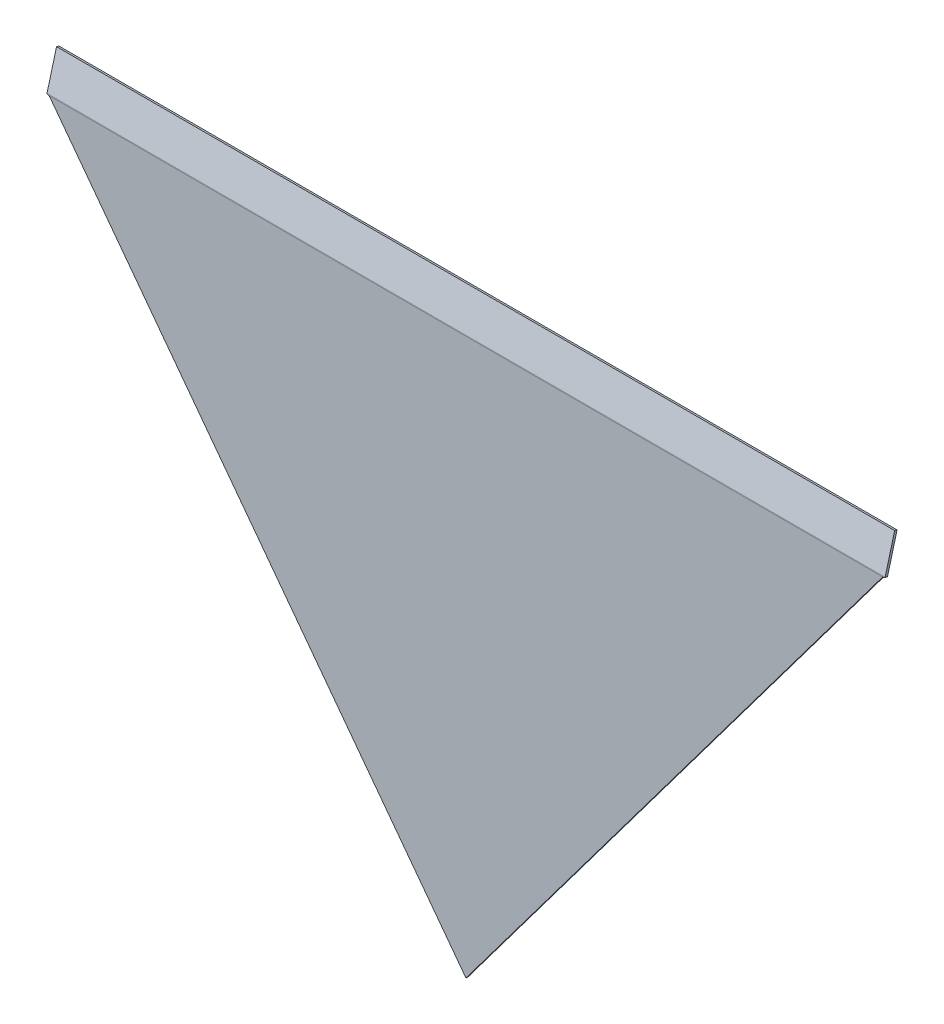
ISO-10303-21;
HEADER;
FILE_DESCRIPTION(('STEP AP214'),'2;1');
FILE_NAME('part.step','',(''),(''),'','','');
FILE_SCHEMA(('AUTOMOTIVE_DESIGN { 1 0 10303 214 1 1 1 1 }'));
ENDSEC;
DATA;
#1=APPLICATION_CONTEXT('core data for automotive mechanical design processes');
#2=APPLICATION_PROTOCOL_DEFINITION('international standard','automotive_design',2000,#1);
#3=PRODUCT_CONTEXT('',#1,'mechanical');
#4=PRODUCT('Part','Part','',(#3));
#5=PRODUCT_RELATED_PRODUCT_CATEGORY('part','',(#4));
#6=PRODUCT_DEFINITION_FORMATION('','',#4);
#7=PRODUCT_DEFINITION_CONTEXT('part definition',#1,'design');
#8=PRODUCT_DEFINITION('design','',#6,#7);
#9=PRODUCT_DEFINITION_SHAPE('','',#8);
#10=(LENGTH_UNIT() NAMED_UNIT(*) SI_UNIT(.MILLI.,.METRE.));
#11=(NAMED_UNIT(*) PLANE_ANGLE_UNIT() SI_UNIT($,.RADIAN.));
#12=(NAMED_UNIT(*) SI_UNIT($,.STERADIAN.) SOLID_ANGLE_UNIT());
#13=UNCERTAINTY_MEASURE_WITH_UNIT(LENGTH_MEASURE(1.E-05),#10,'distance_accuracy_value','');
#14=(GEOMETRIC_REPRESENTATION_CONTEXT(3) GLOBAL_UNCERTAINTY_ASSIGNED_CONTEXT((#13)) GLOBAL_UNIT_ASSIGNED_CONTEXT((#10,
#11,#12)) REPRESENTATION_CONTEXT('',''));
#15=CARTESIAN_POINT('',(0.,0.,0.));
#16=DIRECTION('',(0.,0.,1.));
#17=DIRECTION('',(1.,0.,0.));
#18=AXIS2_PLACEMENT_3D('',#15,#16,#17);
#19=CARTESIAN_POINT('',(0.,-8.20217484210808,-10.7085569512675));
#20=DIRECTION('',(0.,0.258819045102521,0.965925826289068));
#21=DIRECTION('',(1.,0.,0.));
#22=AXIS2_PLACEMENT_3D('',#19,#20,#21);
#23=PLANE('',#22);
#24=DIRECTION('',(0.,-0.965925826289068,0.258819045102521));
#25=VECTOR('',#24,1.);
#26=CARTESIAN_POINT('',(-533.4,-8.20217484210808,-10.7085569512675));
#27=LINE('',#26,#25);
#28=CARTESIAN_POINT('',(-533.4,-8.20217484210808,-10.7085569512675));
#29=VERTEX_POINT('',#28);
#30=CARTESIAN_POINT('',(-533.4,-53.5910294194315,1.45334997810006));
#31=VERTEX_POINT('',#30);
#32=EDGE_CURVE('E82',#29,#31,#27,.T.);
#33=ORIENTED_EDGE('',*,*,#32,.T.);
#34=DIRECTION('',(1.,0.,0.));
#35=VECTOR('',#34,1.);
#36=CARTESIAN_POINT('',(0.,-53.5910294194315,1.45334997810006));
#37=LINE('',#36,#35);
#38=CARTESIAN_POINT('',(533.4,-53.5910294194315,1.45334997810006));
#39=VERTEX_POINT('',#38);
#40=EDGE_CURVE('E43',#31,#39,#37,.T.);
#41=ORIENTED_EDGE('',*,*,#40,.T.);
#42=DIRECTION('',(0.,0.965925826289068,-0.258819045102521));
#43=VECTOR('',#42,1.);
#44=CARTESIAN_POINT('',(533.4,-8.20217484210808,-10.7085569512675));
#45=LINE('',#44,#43);
#46=CARTESIAN_POINT('',(533.4,-8.20217484210808,-10.7085569512675));
#47=VERTEX_POINT('',#46);
#48=EDGE_CURVE('E109',#39,#47,#45,.T.);
#49=ORIENTED_EDGE('',*,*,#48,.T.);
#50=DIRECTION('',(-1.,0.,0.));
#51=VECTOR('',#50,1.);
#52=CARTESIAN_POINT('',(-533.4,-8.20217484210808,-10.7085569512675));
#53=LINE('',#52,#51);
#54=EDGE_CURVE('E59',#47,#29,#53,.T.);
#55=ORIENTED_EDGE('',*,*,#54,.T.);
#56=EDGE_LOOP('',(#33,#41,#49,#55));
#57=FACE_BOUND('',#56,.T.);
#58=ADVANCED_FACE('F35',(#57),#23,.T.);
#59=CARTESIAN_POINT('',(-533.4,-8.20217484210808,-10.7085569512675));
#60=DIRECTION('',(1.,0.,0.));
#61=DIRECTION('',(0.,-0.258819045102521,-0.965925826289068));
#62=AXIS2_PLACEMENT_3D('',#59,#60,#61);
#63=PLANE('',#62);
#64=DIRECTION('',(0.,-0.258819045102521,-0.965925826289068));
#65=VECTOR('',#64,1.);
#66=CARTESIAN_POINT('',(-533.4,-53.5910294194315,1.45334997810006));
#67=LINE('',#66,#65);
#68=CARTESIAN_POINT('',(-533.4,-54.412779887632,-1.61346452036773));
#69=VERTEX_POINT('',#68);
#70=EDGE_CURVE('E103',#31,#69,#67,.T.);
#71=ORIENTED_EDGE('',*,*,#70,.F.);
#72=ORIENTED_EDGE('',*,*,#32,.F.);
#73=DIRECTION('',(0.,-0.258819045102521,-0.965925826289068));
#74=VECTOR('',#73,1.);
#75=CARTESIAN_POINT('',(-533.4,-8.20217484210808,-10.7085569512675));
#76=LINE('',#75,#74);
#77=CARTESIAN_POINT('',(-533.4,-9.02392531030858,-13.7753714497352));
#78=VERTEX_POINT('',#77);
#79=EDGE_CURVE('E75',#29,#78,#76,.T.);
#80=ORIENTED_EDGE('',*,*,#79,.T.);
#81=DIRECTION('',(0.,-0.965925826289068,0.258819045102521));
#82=VECTOR('',#81,1.);
#83=CARTESIAN_POINT('',(-533.4,-9.02392531030858,-13.7753714497352));
#84=LINE('',#83,#82);
#85=EDGE_CURVE('E90',#78,#69,#84,.T.);
#86=ORIENTED_EDGE('',*,*,#85,.T.);
#87=EDGE_LOOP('',(#71,#72,#80,#86));
#88=FACE_BOUND('',#87,.T.);
#89=ADVANCED_FACE('F88',(#88),#63,.F.);
#90=CARTESIAN_POINT('',(533.4,-8.20217484210808,-10.7085569512675));
#91=DIRECTION('',(-1.,0.,0.));
#92=DIRECTION('',(0.,0.258819045102521,0.965925826289068));
#93=AXIS2_PLACEMENT_3D('',#90,#91,#92);
#94=PLANE('',#93);
#95=DIRECTION('',(0.,0.258819045102521,0.965925826289068));
#96=VECTOR('',#95,1.);
#97=CARTESIAN_POINT('',(533.4,-53.5910294194315,1.45334997810006));
#98=LINE('',#97,#96);
#99=CARTESIAN_POINT('',(533.399999999999,-54.412779887632,-1.61346452036773));
#100=VERTEX_POINT('',#99);
#101=EDGE_CURVE('E106',#100,#39,#98,.T.);
#102=ORIENTED_EDGE('',*,*,#101,.F.);
#103=DIRECTION('',(0.,0.965925826289068,-0.258819045102521));
#104=VECTOR('',#103,1.);
#105=CARTESIAN_POINT('',(533.4,-9.02392531030858,-13.7753714497352));
#106=LINE('',#105,#104);
#107=CARTESIAN_POINT('',(533.4,-9.02392531030858,-13.7753714497352));
#108=VERTEX_POINT('',#107);
#109=EDGE_CURVE('E83',#100,#108,#106,.T.);
#110=ORIENTED_EDGE('',*,*,#109,.T.);
#111=DIRECTION('',(0.,-0.258819045102521,-0.965925826289068));
#112=VECTOR('',#111,1.);
#113=CARTESIAN_POINT('',(533.4,-8.20217484210808,-10.7085569512675));
#114=LINE('',#113,#112);
#115=EDGE_CURVE('E78',#47,#108,#114,.T.);
#116=ORIENTED_EDGE('',*,*,#115,.F.);
#117=ORIENTED_EDGE('',*,*,#48,.F.);
#118=EDGE_LOOP('',(#102,#110,#116,#117));
#119=FACE_BOUND('',#118,.T.);
#120=ADVANCED_FACE('F115',(#119),#94,.F.);
#121=CARTESIAN_POINT('',(-533.4,-8.20217484210808,-10.7085569512675));
#122=DIRECTION('',(0.,-0.965925826289068,0.258819045102521));
#123=DIRECTION('',(0.,-0.258819045102521,-0.965925826289068));
#124=AXIS2_PLACEMENT_3D('',#121,#122,#123);
#125=PLANE('',#124);
#126=DIRECTION('',(-1.,0.,0.));
#127=VECTOR('',#126,1.);
#128=CARTESIAN_POINT('',(-533.4,-9.02392531030858,-13.7753714497352));
#129=LINE('',#128,#127);
#130=EDGE_CURVE('E72',#108,#78,#129,.T.);
#131=ORIENTED_EDGE('',*,*,#130,.T.);
#132=ORIENTED_EDGE('',*,*,#79,.F.);
#133=ORIENTED_EDGE('',*,*,#54,.F.);
#134=ORIENTED_EDGE('',*,*,#115,.T.);
#135=EDGE_LOOP('',(#131,#132,#133,#134));
#136=FACE_BOUND('',#135,.T.);
#137=ADVANCED_FACE('F74',(#136),#125,.F.);
#138=CARTESIAN_POINT('',(0.,-9.02392531030858,-13.7753714497352));
#139=DIRECTION('',(0.,0.258819045102521,0.965925826289068));
#140=DIRECTION('',(1.,0.,0.));
#141=AXIS2_PLACEMENT_3D('',#138,#139,#140);
#142=PLANE('',#141);
#143=DIRECTION('',(1.,0.,0.));
#144=VECTOR('',#143,1.);
#145=CARTESIAN_POINT('',(0.,-54.412779887632,-1.61346452036773));
#146=LINE('',#145,#144);
#147=EDGE_CURVE('E11',#69,#100,#146,.T.);
#148=ORIENTED_EDGE('',*,*,#147,.F.);
#149=ORIENTED_EDGE('',*,*,#85,.F.);
#150=ORIENTED_EDGE('',*,*,#130,.F.);
#151=ORIENTED_EDGE('',*,*,#109,.F.);
#152=EDGE_LOOP('',(#148,#149,#150,#151));
#153=FACE_BOUND('',#152,.T.);
#154=ADVANCED_FACE('F37',(#153),#142,.F.);
#155=CARTESIAN_POINT('',(533.4,-50.8000000000001,1.5875));
#156=DIRECTION('',(-0.8,0.6,0.));
#157=DIRECTION('',(-0.6,-0.8,0.));
#158=AXIS2_PLACEMENT_3D('',#155,#156,#157);
#159=PLANE('',#158);
#160=DIRECTION('',(0.6,0.8,0.));
#161=VECTOR('',#160,1.);
#162=CARTESIAN_POINT('',(533.4,-50.8000000000001,-1.5875));
#163=LINE('',#162,#161);
#164=CARTESIAN_POINT('',(0.,-762.,-1.5875));
#165=VERTEX_POINT('',#164);
#166=CARTESIAN_POINT('',(530.5425,-54.6100000000002,-1.5875));
#167=VERTEX_POINT('',#166);
#168=EDGE_CURVE('E171',#165,#167,#163,.T.);
#169=ORIENTED_EDGE('',*,*,#168,.T.);
#170=CARTESIAN_POINT('',(530.542499999998,-54.6100000000001,1.5875));
#171=CARTESIAN_POINT('',(530.542499999998,-54.6100000000001,-1.5875));
#172=B_SPLINE_CURVE_WITH_KNOTS('',1,(#170,#171),.UNSPECIFIED.,.F.,.F.,(2,2),(0.,1.),.UNSPECIFIED.);
#173=CARTESIAN_POINT('',(530.542499999999,-54.6100000000001,1.5875));
#174=VERTEX_POINT('',#173);
#175=EDGE_CURVE('E173',#167,#174,#172,.F.);
#176=ORIENTED_EDGE('',*,*,#175,.T.);
#177=DIRECTION('',(0.6,0.8,0.));
#178=VECTOR('',#177,1.);
#179=CARTESIAN_POINT('',(533.4,-50.8000000000001,1.5875));
#180=LINE('',#179,#178);
#181=CARTESIAN_POINT('',(0.,-762.,1.5875));
#182=VERTEX_POINT('',#181);
#183=EDGE_CURVE('E198',#182,#174,#180,.T.);
#184=ORIENTED_EDGE('',*,*,#183,.F.);
#185=DIRECTION('',(0.,0.,-1.));
#186=VECTOR('',#185,1.);
#187=CARTESIAN_POINT('',(0.,-762.,1.5875));
#188=LINE('',#187,#186);
#189=EDGE_CURVE('E180',#182,#165,#188,.T.);
#190=ORIENTED_EDGE('',*,*,#189,.T.);
#191=EDGE_LOOP('',(#169,#176,#184,#190));
#192=FACE_BOUND('',#191,.T.);
#193=ADVANCED_FACE('F125',(#192),#159,.F.);
#194=CARTESIAN_POINT('',(0.,0.,1.5875));
#195=DIRECTION('',(0.,0.,1.));
#196=DIRECTION('',(1.,0.,0.));
#197=AXIS2_PLACEMENT_3D('',#194,#195,#196);
#198=PLANE('',#197);
#199=DIRECTION('',(1.,0.,0.));
#200=VECTOR('',#199,1.);
#201=CARTESIAN_POINT('',(0.,-54.6100000000001,1.5875));
#202=LINE('',#201,#200);
#203=CARTESIAN_POINT('',(-530.5425,-54.6100000000001,1.5875));
#204=VERTEX_POINT('',#203);
#205=EDGE_CURVE('E174',#204,#174,#202,.T.);
#206=ORIENTED_EDGE('',*,*,#205,.F.);
#207=DIRECTION('',(0.6,-0.8,0.));
#208=VECTOR('',#207,1.);
#209=CARTESIAN_POINT('',(-533.4,-50.8000000000001,1.5875));
#210=LINE('',#209,#208);
#211=EDGE_CURVE('E196',#204,#182,#210,.T.);
#212=ORIENTED_EDGE('',*,*,#211,.T.);
#213=ORIENTED_EDGE('',*,*,#183,.T.);
#214=EDGE_LOOP('',(#206,#212,#213));
#215=FACE_BOUND('',#214,.T.);
#216=ADVANCED_FACE('F135',(#215),#198,.T.);
#217=CARTESIAN_POINT('',(-533.4,-50.8000000000001,1.5875));
#218=DIRECTION('',(0.8,0.6,0.));
#219=DIRECTION('',(-0.6,0.8,0.));
#220=AXIS2_PLACEMENT_3D('',#217,#218,#219);
#221=PLANE('',#220);
#222=ORIENTED_EDGE('',*,*,#211,.F.);
#223=CARTESIAN_POINT('',(-530.542500000001,-54.6100000000001,-1.5875));
#224=CARTESIAN_POINT('',(-530.542500000001,-54.6100000000001,1.5875));
#225=B_SPLINE_CURVE_WITH_KNOTS('',1,(#223,#224),.UNSPECIFIED.,.F.,.F.,(2,2),(0.,1.),.UNSPECIFIED.);
#226=CARTESIAN_POINT('',(-530.5425,-54.6100000000001,-1.5875));
#227=VERTEX_POINT('',#226);
#228=EDGE_CURVE('E168',#204,#227,#225,.F.);
#229=ORIENTED_EDGE('',*,*,#228,.T.);
#230=DIRECTION('',(0.6,-0.8,0.));
#231=VECTOR('',#230,1.);
#232=CARTESIAN_POINT('',(-533.4,-50.8000000000001,-1.5875));
#233=LINE('',#232,#231);
#234=EDGE_CURVE('E97',#227,#165,#233,.T.);
#235=ORIENTED_EDGE('',*,*,#234,.T.);
#236=ORIENTED_EDGE('',*,*,#189,.F.);
#237=EDGE_LOOP('',(#222,#229,#235,#236));
#238=FACE_BOUND('',#237,.T.);
#239=ADVANCED_FACE('F144',(#238),#221,.F.);
#240=CARTESIAN_POINT('',(0.,0.,-1.5875));
#241=DIRECTION('',(0.,0.,1.));
#242=DIRECTION('',(1.,0.,0.));
#243=AXIS2_PLACEMENT_3D('',#240,#241,#242);
#244=PLANE('',#243);
#245=ORIENTED_EDGE('',*,*,#234,.F.);
#246=DIRECTION('',(1.,0.,0.));
#247=VECTOR('',#246,1.);
#248=CARTESIAN_POINT('',(0.,-54.6100000000001,-1.5875));
#249=LINE('',#248,#247);
#250=EDGE_CURVE('E93',#227,#167,#249,.T.);
#251=ORIENTED_EDGE('',*,*,#250,.T.);
#252=ORIENTED_EDGE('',*,*,#168,.F.);
#253=EDGE_LOOP('',(#245,#251,#252));
#254=FACE_BOUND('',#253,.T.);
#255=ADVANCED_FACE('F149',(#254),#244,.F.);
#256=CARTESIAN_POINT('',(533.4,-54.6100000000001,-2.3495));
#257=DIRECTION('',(1.,0.,0.));
#258=DIRECTION('',(0.,0.,-1.));
#259=AXIS2_PLACEMENT_3D('',#256,#257,#258);
#260=PLANE('',#259);
#261=CARTESIAN_POINT('',(533.399999999998,-54.5105390415285,-1.59401901563315));
#262=CARTESIAN_POINT('',(533.399999999998,-54.0961183812298,1.5538184192287));
#263=B_SPLINE_CURVE_WITH_KNOTS('',1,(#261,#262),.UNSPECIFIED.,.F.,.F.,(2,2),(0.,1.),.UNSPECIFIED.);
#264=CARTESIAN_POINT('',(533.399999999999,-54.5105390415285,-1.59401901563316));
#265=VERTEX_POINT('',#264);
#266=CARTESIAN_POINT('',(533.399999999999,-54.0961183812298,1.55381841922869));
#267=VERTEX_POINT('',#266);
#268=EDGE_CURVE('E182',#265,#267,#263,.T.);
#269=ORIENTED_EDGE('',*,*,#268,.F.);
#270=CARTESIAN_POINT('',(533.399999999999,-54.6100000000001,-2.3495));
#271=DIRECTION('',(1.,0.,0.));
#272=DIRECTION('',(0.,0.,-1.));
#273=AXIS2_PLACEMENT_3D('',#270,#271,#272);
#274=CIRCLE('',#273,0.761999999999999);
#275=EDGE_CURVE('E327',#265,#100,#274,.F.);
#276=ORIENTED_EDGE('',*,*,#275,.T.);
#277=ORIENTED_EDGE('',*,*,#101,.T.);
#278=CARTESIAN_POINT('',(533.399999999999,-54.6100000000001,-2.3495));
#279=DIRECTION('',(1.,0.,0.));
#280=DIRECTION('',(0.,0.,-1.));
#281=AXIS2_PLACEMENT_3D('',#278,#279,#280);
#282=CIRCLE('',#281,3.937);
#283=EDGE_CURVE('E50',#267,#39,#282,.F.);
#284=ORIENTED_EDGE('',*,*,#283,.F.);
#285=EDGE_LOOP('',(#269,#276,#277,#284));
#286=FACE_BOUND('',#285,.T.);
#287=ADVANCED_FACE('F224',(#286),#260,.T.);
#288=CARTESIAN_POINT('',(-533.4,-54.6100000000001,-2.3495));
#289=DIRECTION('',(-1.,0.,0.));
#290=DIRECTION('',(0.,0.,1.));
#291=AXIS2_PLACEMENT_3D('',#288,#289,#290);
#292=PLANE('',#291);
#293=ORIENTED_EDGE('',*,*,#70,.T.);
#294=CARTESIAN_POINT('',(-533.4,-54.6100000000001,-2.3495));
#295=DIRECTION('',(1.,0.,0.));
#296=DIRECTION('',(0.,0.,-1.));
#297=AXIS2_PLACEMENT_3D('',#294,#295,#296);
#298=CIRCLE('',#297,0.761999999999999);
#299=CARTESIAN_POINT('',(-533.400000000001,-54.5105390415285,-1.59401901563316));
#300=VERTEX_POINT('',#299);
#301=EDGE_CURVE('E319',#69,#300,#298,.T.);
#302=ORIENTED_EDGE('',*,*,#301,.T.);
#303=CARTESIAN_POINT('',(-533.400000000001,-54.0961183812298,1.5538184192287));
#304=CARTESIAN_POINT('',(-533.400000000001,-54.5105390415285,-1.59401901563315));
#305=B_SPLINE_CURVE_WITH_KNOTS('',1,(#303,#304),.UNSPECIFIED.,.F.,.F.,(2,2),(0.,1.),.UNSPECIFIED.);
#306=CARTESIAN_POINT('',(-533.400000000001,-54.0961183812298,1.55381841922869));
#307=VERTEX_POINT('',#306);
#308=EDGE_CURVE('E189',#300,#307,#305,.F.);
#309=ORIENTED_EDGE('',*,*,#308,.T.);
#310=CARTESIAN_POINT('',(-533.4,-54.6100000000001,-2.3495));
#311=DIRECTION('',(1.,0.,0.));
#312=DIRECTION('',(0.,0.,-1.));
#313=AXIS2_PLACEMENT_3D('',#310,#311,#312);
#314=CIRCLE('',#313,3.937);
#315=EDGE_CURVE('E287',#31,#307,#314,.T.);
#316=ORIENTED_EDGE('',*,*,#315,.F.);
#317=EDGE_LOOP('',(#293,#302,#309,#316));
#318=FACE_BOUND('',#317,.T.);
#319=ADVANCED_FACE('F233',(#318),#292,.T.);
#320=CARTESIAN_POINT('',(-533.400000000001,-54.0961183812298,1.5538184192287));
#321=CARTESIAN_POINT('',(-532.447499729814,-54.2664328249645,1.57624074112159));
#322=CARTESIAN_POINT('',(-531.495000270188,-54.4382159196441,1.58749999999999));
#323=CARTESIAN_POINT('',(-530.542500000001,-54.6100000000001,1.5875));
#324=CARTESIAN_POINT('',(-533.400000000001,-54.5105390415285,-1.59401901563315));
#325=CARTESIAN_POINT('',(-532.447499989556,-54.5435031184235,-1.58967921257925));
#326=CARTESIAN_POINT('',(-531.495000010447,-54.576751477385,-1.58750000000002));
#327=CARTESIAN_POINT('',(-530.542500000001,-54.6100000000001,-1.5875));
#328=B_SPLINE_SURFACE_WITH_KNOTS('',1,3,((#320,#321,#322,#323),(#324,#325,#326,#327)),
.UNSPECIFIED.,.F.,.F.,.F.,(2,2),(4,4),(0.,1.),(0.,1.),.UNSPECIFIED.);
#329=CARTESIAN_POINT('',(-533.400000000001,-54.5105390415285,-1.59401901563315));
#330=CARTESIAN_POINT('',(-532.447499989556,-54.5435031184235,-1.58967921257925));
#331=CARTESIAN_POINT('',(-531.495000010447,-54.576751477385,-1.58750000000002));
#332=CARTESIAN_POINT('',(-530.542500000001,-54.6100000000001,-1.5875));
#333=B_SPLINE_CURVE_WITH_KNOTS('',3,(#329,#330,#331,#332),.UNSPECIFIED.,.F.,.F.,(4,4),(0.,1.),.UNSPECIFIED.);
#334=EDGE_CURVE('E328',#300,#227,#333,.T.);
#335=CARTESIAN_POINT('',(-530.542500000001,-54.6100000000001,1.5875));
#336=CARTESIAN_POINT('',(-531.495000270188,-54.4382159196441,1.58749999999999));
#337=CARTESIAN_POINT('',(-532.447499729814,-54.2664328249645,1.57624074112159));
#338=CARTESIAN_POINT('',(-533.400000000001,-54.0961183812298,1.5538184192287));
#339=B_SPLINE_CURVE_WITH_KNOTS('',3,(#335,#336,#337,#338),.UNSPECIFIED.,.F.,.F.,(4,4),(0.,1.),.UNSPECIFIED.);
#340=EDGE_CURVE('E334',#307,#204,#339,.F.);
#341=ORIENTED_EDGE('',*,*,#308,.F.);
#342=ORIENTED_EDGE('',*,*,#334,.T.);
#343=ORIENTED_EDGE('',*,*,#228,.F.);
#344=ORIENTED_EDGE('',*,*,#340,.F.);
#345=EDGE_LOOP('',(#341,#342,#343,#344));
#346=FACE_BOUND('',#345,.T.);
#347=ADVANCED_FACE('F238',(#346),#328,.T.);
#348=CARTESIAN_POINT('',(530.542499999998,-54.6100000000001,1.5875));
#349=CARTESIAN_POINT('',(531.495000270187,-54.4382159196439,1.58750000000002));
#350=CARTESIAN_POINT('',(532.44749972981,-54.2664328249647,1.57624074112158));
#351=CARTESIAN_POINT('',(533.399999999998,-54.0961183812298,1.5538184192287));
#352=CARTESIAN_POINT('',(530.542499999998,-54.6100000000001,-1.5875));
#353=CARTESIAN_POINT('',(531.495000010445,-54.576751477385,-1.58749999999997));
#354=CARTESIAN_POINT('',(532.447499989552,-54.5435031184235,-1.58967921257928));
#355=CARTESIAN_POINT('',(533.399999999998,-54.5105390415285,-1.59401901563315));
#356=B_SPLINE_SURFACE_WITH_KNOTS('',1,3,((#348,#349,#350,#351),(#352,#353,#354,#355)),
.UNSPECIFIED.,.F.,.F.,.F.,(2,2),(4,4),(0.,1.),(0.,1.),.UNSPECIFIED.);
#357=CARTESIAN_POINT('',(530.542499999998,-54.6100000000001,-1.5875));
#358=CARTESIAN_POINT('',(531.495000010445,-54.576751477385,-1.58749999999997));
#359=CARTESIAN_POINT('',(532.447499989552,-54.5435031184235,-1.58967921257928));
#360=CARTESIAN_POINT('',(533.399999999998,-54.5105390415285,-1.59401901563315));
#361=B_SPLINE_CURVE_WITH_KNOTS('',3,(#357,#358,#359,#360),.UNSPECIFIED.,.F.,.F.,(4,4),(0.,1.),.UNSPECIFIED.);
#362=EDGE_CURVE('E282',#167,#265,#361,.T.);
#363=CARTESIAN_POINT('',(533.399999999998,-54.0961183812298,1.5538184192287));
#364=CARTESIAN_POINT('',(532.44749972981,-54.2664328249647,1.57624074112158));
#365=CARTESIAN_POINT('',(531.495000270187,-54.4382159196439,1.58750000000002));
#366=CARTESIAN_POINT('',(530.542499999998,-54.6100000000001,1.5875));
#367=B_SPLINE_CURVE_WITH_KNOTS('',3,(#363,#364,#365,#366),.UNSPECIFIED.,.F.,.F.,(4,4),(0.,1.),.UNSPECIFIED.);
#368=EDGE_CURVE('E279',#174,#267,#367,.F.);
#369=ORIENTED_EDGE('',*,*,#362,.T.);
#370=ORIENTED_EDGE('',*,*,#268,.T.);
#371=ORIENTED_EDGE('',*,*,#368,.F.);
#372=ORIENTED_EDGE('',*,*,#175,.F.);
#373=EDGE_LOOP('',(#369,#370,#371,#372));
#374=FACE_BOUND('',#373,.T.);
#375=ADVANCED_FACE('F137',(#374),#356,.T.);
#376=CARTESIAN_POINT('',(-1844.39821534013,-54.6100000000001,-2.3495));
#377=DIRECTION('',(1.,0.,0.));
#378=DIRECTION('',(0.,0.,-1.));
#379=AXIS2_PLACEMENT_3D('',#376,#377,#378);
#380=CYLINDRICAL_SURFACE('',#379,3.937);
#381=ORIENTED_EDGE('',*,*,#205,.T.);
#382=ORIENTED_EDGE('',*,*,#368,.T.);
#383=ORIENTED_EDGE('',*,*,#283,.T.);
#384=ORIENTED_EDGE('',*,*,#40,.F.);
#385=ORIENTED_EDGE('',*,*,#315,.T.);
#386=ORIENTED_EDGE('',*,*,#340,.T.);
#387=EDGE_LOOP('',(#381,#382,#383,#384,#385,#386));
#388=FACE_BOUND('',#387,.T.);
#389=ADVANCED_FACE('F290',(#388),#380,.T.);
#390=CARTESIAN_POINT('',(-1844.39821534013,-54.6100000000001,-2.3495));
#391=DIRECTION('',(1.,0.,0.));
#392=DIRECTION('',(0.,0.,-1.));
#393=AXIS2_PLACEMENT_3D('',#390,#391,#392);
#394=CYLINDRICAL_SURFACE('',#393,0.761999999999999);
#395=ORIENTED_EDGE('',*,*,#250,.F.);
#396=ORIENTED_EDGE('',*,*,#334,.F.);
#397=ORIENTED_EDGE('',*,*,#301,.F.);
#398=ORIENTED_EDGE('',*,*,#147,.T.);
#399=ORIENTED_EDGE('',*,*,#275,.F.);
#400=ORIENTED_EDGE('',*,*,#362,.F.);
#401=EDGE_LOOP('',(#395,#396,#397,#398,#399,#400));
#402=FACE_BOUND('',#401,.T.);
#403=ADVANCED_FACE('F303',(#402),#394,.F.);
#404=CLOSED_SHELL('',(#58,#89,#120,#137,#154,#193,#216,#239,#255,#287,#319,#347,#375,#389,#403));
#405=MANIFOLD_SOLID_BREP('B2',#404);
#406=ADVANCED_BREP_SHAPE_REPRESENTATION('',(#18,#405),#14);
#407=SHAPE_DEFINITION_REPRESENTATION(#9,#406);
ENDSEC;
END-ISO-10303-21;
